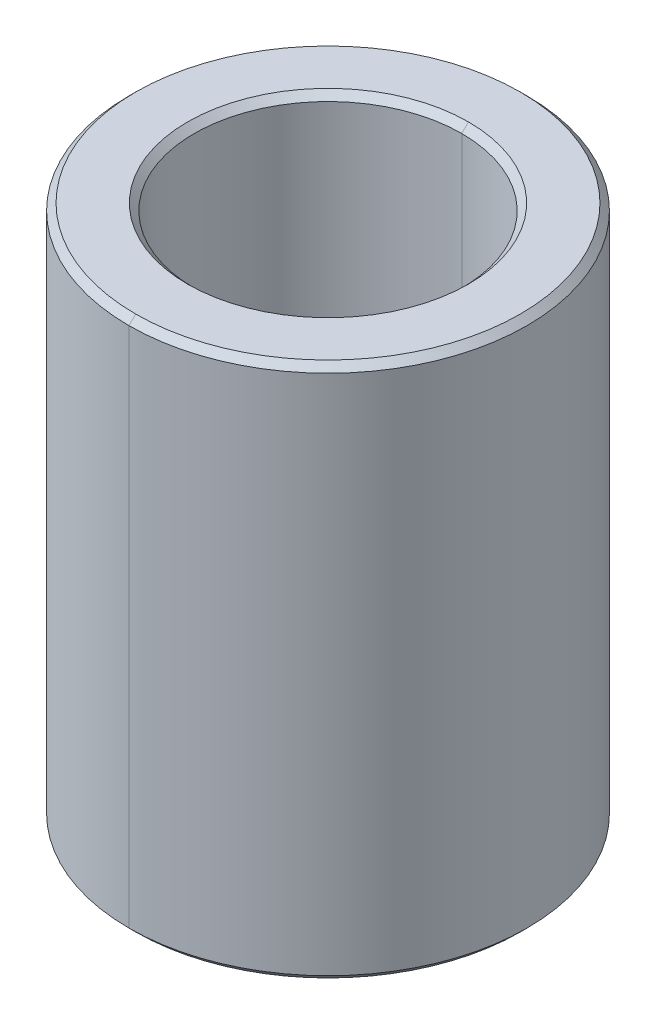
ISO-10303-21;
HEADER;
FILE_DESCRIPTION(('STEP AP214'),'2;1');
FILE_NAME('part.step','',(''),(''),'','','');
FILE_SCHEMA(('AUTOMOTIVE_DESIGN { 1 0 10303 214 1 1 1 1 }'));
ENDSEC;
DATA;
#1=APPLICATION_CONTEXT('core data for automotive mechanical design processes');
#2=APPLICATION_PROTOCOL_DEFINITION('international standard','automotive_design',2000,#1);
#3=PRODUCT_CONTEXT('',#1,'mechanical');
#4=PRODUCT('Part','Part','',(#3));
#5=PRODUCT_RELATED_PRODUCT_CATEGORY('part','',(#4));
#6=PRODUCT_DEFINITION_FORMATION('','',#4);
#7=PRODUCT_DEFINITION_CONTEXT('part definition',#1,'design');
#8=PRODUCT_DEFINITION('design','',#6,#7);
#9=PRODUCT_DEFINITION_SHAPE('','',#8);
#10=(LENGTH_UNIT() NAMED_UNIT(*) SI_UNIT(.MILLI.,.METRE.));
#11=(NAMED_UNIT(*) PLANE_ANGLE_UNIT() SI_UNIT($,.RADIAN.));
#12=(NAMED_UNIT(*) SI_UNIT($,.STERADIAN.) SOLID_ANGLE_UNIT());
#13=UNCERTAINTY_MEASURE_WITH_UNIT(LENGTH_MEASURE(1.E-05),#10,'distance_accuracy_value','');
#14=(GEOMETRIC_REPRESENTATION_CONTEXT(3) GLOBAL_UNCERTAINTY_ASSIGNED_CONTEXT((#13)) GLOBAL_UNIT_ASSIGNED_CONTEXT((#10,
#11,#12)) REPRESENTATION_CONTEXT('',''));
#15=CARTESIAN_POINT('',(0.,0.,0.));
#16=DIRECTION('',(0.,0.,1.));
#17=DIRECTION('',(1.,0.,0.));
#18=AXIS2_PLACEMENT_3D('',#15,#16,#17);
#19=CARTESIAN_POINT('',(0.,3.9,0.));
#20=DIRECTION('',(0.,1.,0.));
#21=DIRECTION('',(0.,0.,1.));
#22=AXIS2_PLACEMENT_3D('',#19,#20,#21);
#23=CONICAL_SURFACE('',#22,2.,0.785398163397448);
#24=DIRECTION('',(0.,0.707106781186548,-0.707106781186548));
#25=VECTOR('',#24,1.);
#26=CARTESIAN_POINT('',(0.,3.9,-2.));
#27=LINE('',#26,#25);
#28=CARTESIAN_POINT('',(0.,3.9,-2.));
#29=VERTEX_POINT('',#28);
#30=CARTESIAN_POINT('',(0.,4.,-2.1));
#31=VERTEX_POINT('',#30);
#32=EDGE_CURVE('E135',#29,#31,#27,.T.);
#33=ORIENTED_EDGE('',*,*,#32,.F.);
#34=CARTESIAN_POINT('',(0.,3.9,0.));
#35=DIRECTION('',(0.,1.,0.));
#36=DIRECTION('',(0.,0.,1.));
#37=AXIS2_PLACEMENT_3D('',#34,#35,#36);
#38=CIRCLE('',#37,2.);
#39=CARTESIAN_POINT('',(0.,3.9,2.));
#40=VERTEX_POINT('',#39);
#41=EDGE_CURVE('E24',#40,#29,#38,.T.);
#42=ORIENTED_EDGE('',*,*,#41,.F.);
#43=DIRECTION('',(0.,0.707106781186548,0.707106781186548));
#44=VECTOR('',#43,1.);
#45=CARTESIAN_POINT('',(0.,3.9,2.));
#46=LINE('',#45,#44);
#47=CARTESIAN_POINT('',(0.,4.,2.1));
#48=VERTEX_POINT('',#47);
#49=EDGE_CURVE('E145',#40,#48,#46,.T.);
#50=ORIENTED_EDGE('',*,*,#49,.T.);
#51=CARTESIAN_POINT('',(0.,4.,0.));
#52=DIRECTION('',(0.,-1.,0.));
#53=DIRECTION('',(0.,0.,1.));
#54=AXIS2_PLACEMENT_3D('',#51,#52,#53);
#55=CIRCLE('',#54,2.1);
#56=EDGE_CURVE('E137',#31,#48,#55,.T.);
#57=ORIENTED_EDGE('',*,*,#56,.F.);
#58=EDGE_LOOP('',(#33,#42,#50,#57));
#59=FACE_BOUND('',#58,.T.);
#60=ADVANCED_FACE('F14',(#59),#23,.F.);
#61=CARTESIAN_POINT('',(0.,-4.,0.));
#62=DIRECTION('',(0.,-1.,0.));
#63=DIRECTION('',(0.,0.,-1.));
#64=AXIS2_PLACEMENT_3D('',#61,#62,#63);
#65=CONICAL_SURFACE('',#64,2.1,0.785398163397443);
#66=DIRECTION('',(0.,-0.707106781186551,0.707106781186545));
#67=VECTOR('',#66,1.);
#68=CARTESIAN_POINT('',(0.,-4.,2.1));
#69=LINE('',#68,#67);
#70=CARTESIAN_POINT('',(0.,-3.9,2.));
#71=VERTEX_POINT('',#70);
#72=CARTESIAN_POINT('',(0.,-4.,2.1));
#73=VERTEX_POINT('',#72);
#74=EDGE_CURVE('E164',#71,#73,#69,.T.);
#75=ORIENTED_EDGE('',*,*,#74,.F.);
#76=CARTESIAN_POINT('',(0.,-3.9,0.));
#77=DIRECTION('',(0.,-1.,0.));
#78=DIRECTION('',(0.,0.,1.));
#79=AXIS2_PLACEMENT_3D('',#76,#77,#78);
#80=CIRCLE('',#79,2.);
#81=CARTESIAN_POINT('',(0.,-3.9,-2.));
#82=VERTEX_POINT('',#81);
#83=EDGE_CURVE('E9',#82,#71,#80,.T.);
#84=ORIENTED_EDGE('',*,*,#83,.F.);
#85=DIRECTION('',(0.,-0.707106781186551,-0.707106781186545));
#86=VECTOR('',#85,1.);
#87=CARTESIAN_POINT('',(0.,-4.,-2.1));
#88=LINE('',#87,#86);
#89=CARTESIAN_POINT('',(0.,-4.,-2.1));
#90=VERTEX_POINT('',#89);
#91=EDGE_CURVE('E173',#82,#90,#88,.T.);
#92=ORIENTED_EDGE('',*,*,#91,.T.);
#93=CARTESIAN_POINT('',(0.,-4.,0.));
#94=DIRECTION('',(0.,1.,0.));
#95=DIRECTION('',(0.,0.,1.));
#96=AXIS2_PLACEMENT_3D('',#93,#94,#95);
#97=CIRCLE('',#96,2.1);
#98=EDGE_CURVE('E18',#73,#90,#97,.T.);
#99=ORIENTED_EDGE('',*,*,#98,.F.);
#100=EDGE_LOOP('',(#75,#84,#92,#99));
#101=FACE_BOUND('',#100,.T.);
#102=ADVANCED_FACE('F266',(#101),#65,.F.);
#103=CARTESIAN_POINT('',(0.,4.,0.));
#104=DIRECTION('',(0.,-1.,0.));
#105=DIRECTION('',(0.,0.,-1.));
#106=AXIS2_PLACEMENT_3D('',#103,#104,#105);
#107=CONICAL_SURFACE('',#106,2.875,0.78539816339744);
#108=DIRECTION('',(0.,-0.707106781186554,0.707106781186542));
#109=VECTOR('',#108,1.);
#110=CARTESIAN_POINT('',(0.,4.,2.875));
#111=LINE('',#110,#109);
#112=CARTESIAN_POINT('',(0.,4.,2.875));
#113=VERTEX_POINT('',#112);
#114=CARTESIAN_POINT('',(0.,3.9,2.975));
#115=VERTEX_POINT('',#114);
#116=EDGE_CURVE('E204',#113,#115,#111,.T.);
#117=ORIENTED_EDGE('',*,*,#116,.F.);
#118=CARTESIAN_POINT('',(0.,4.,0.));
#119=DIRECTION('',(0.,1.,0.));
#120=DIRECTION('',(0.,0.,1.));
#121=AXIS2_PLACEMENT_3D('',#118,#119,#120);
#122=CIRCLE('',#121,2.875);
#123=CARTESIAN_POINT('',(0.,4.,-2.875));
#124=VERTEX_POINT('',#123);
#125=EDGE_CURVE('E157',#124,#113,#122,.T.);
#126=ORIENTED_EDGE('',*,*,#125,.F.);
#127=DIRECTION('',(0.,-0.707106781186554,-0.707106781186542));
#128=VECTOR('',#127,1.);
#129=CARTESIAN_POINT('',(0.,4.,-2.875));
#130=LINE('',#129,#128);
#131=CARTESIAN_POINT('',(0.,3.9,-2.975));
#132=VERTEX_POINT('',#131);
#133=EDGE_CURVE('E199',#124,#132,#130,.T.);
#134=ORIENTED_EDGE('',*,*,#133,.T.);
#135=CARTESIAN_POINT('',(0.,3.9,0.));
#136=DIRECTION('',(0.,-1.,0.));
#137=DIRECTION('',(0.,0.,1.));
#138=AXIS2_PLACEMENT_3D('',#135,#136,#137);
#139=CIRCLE('',#138,2.975);
#140=EDGE_CURVE('E163',#115,#132,#139,.T.);
#141=ORIENTED_EDGE('',*,*,#140,.F.);
#142=EDGE_LOOP('',(#117,#126,#134,#141));
#143=FACE_BOUND('',#142,.T.);
#144=ADVANCED_FACE('F229',(#143),#107,.T.);
#145=CARTESIAN_POINT('',(0.,-3.9,0.));
#146=DIRECTION('',(0.,1.,0.));
#147=DIRECTION('',(0.,0.,1.));
#148=AXIS2_PLACEMENT_3D('',#145,#146,#147);
#149=CONICAL_SURFACE('',#148,2.975,0.78539816339744);
#150=DIRECTION('',(0.,0.707106781186554,-0.707106781186542));
#151=VECTOR('',#150,1.);
#152=CARTESIAN_POINT('',(0.,-3.9,-2.975));
#153=LINE('',#152,#151);
#154=CARTESIAN_POINT('',(0.,-4.,-2.875));
#155=VERTEX_POINT('',#154);
#156=CARTESIAN_POINT('',(0.,-3.9,-2.975));
#157=VERTEX_POINT('',#156);
#158=EDGE_CURVE('E196',#155,#157,#153,.T.);
#159=ORIENTED_EDGE('',*,*,#158,.F.);
#160=CARTESIAN_POINT('',(0.,-4.,0.));
#161=DIRECTION('',(0.,-1.,0.));
#162=DIRECTION('',(0.,0.,1.));
#163=AXIS2_PLACEMENT_3D('',#160,#161,#162);
#164=CIRCLE('',#163,2.875);
#165=CARTESIAN_POINT('',(0.,-4.,2.875));
#166=VERTEX_POINT('',#165);
#167=EDGE_CURVE('E158',#166,#155,#164,.T.);
#168=ORIENTED_EDGE('',*,*,#167,.F.);
#169=DIRECTION('',(0.,0.707106781186554,0.707106781186542));
#170=VECTOR('',#169,1.);
#171=CARTESIAN_POINT('',(0.,-3.9,2.975));
#172=LINE('',#171,#170);
#173=CARTESIAN_POINT('',(0.,-3.9,2.975));
#174=VERTEX_POINT('',#173);
#175=EDGE_CURVE('E184',#166,#174,#172,.T.);
#176=ORIENTED_EDGE('',*,*,#175,.T.);
#177=CARTESIAN_POINT('',(0.,-3.9,0.));
#178=DIRECTION('',(0.,1.,0.));
#179=DIRECTION('',(0.,0.,1.));
#180=AXIS2_PLACEMENT_3D('',#177,#178,#179);
#181=CIRCLE('',#180,2.975);
#182=EDGE_CURVE('E37',#157,#174,#181,.T.);
#183=ORIENTED_EDGE('',*,*,#182,.F.);
#184=EDGE_LOOP('',(#159,#168,#176,#183));
#185=FACE_BOUND('',#184,.T.);
#186=ADVANCED_FACE('F274',(#185),#149,.T.);
#187=CARTESIAN_POINT('',(0.,4.,0.));
#188=DIRECTION('',(0.,-1.,0.));
#189=DIRECTION('',(0.,0.,-1.));
#190=AXIS2_PLACEMENT_3D('',#187,#188,#189);
#191=CYLINDRICAL_SURFACE('',#190,2.);
#192=DIRECTION('',(0.,-1.,0.));
#193=VECTOR('',#192,1.);
#194=CARTESIAN_POINT('',(0.,4.,2.));
#195=LINE('',#194,#193);
#196=EDGE_CURVE('E116',#40,#71,#195,.T.);
#197=ORIENTED_EDGE('',*,*,#196,.F.);
#198=ORIENTED_EDGE('',*,*,#41,.T.);
#199=DIRECTION('',(0.,-1.,0.));
#200=VECTOR('',#199,1.);
#201=CARTESIAN_POINT('',(0.,4.,-2.));
#202=LINE('',#201,#200);
#203=EDGE_CURVE('E113',#29,#82,#202,.T.);
#204=ORIENTED_EDGE('',*,*,#203,.T.);
#205=ORIENTED_EDGE('',*,*,#83,.T.);
#206=EDGE_LOOP('',(#197,#198,#204,#205));
#207=FACE_BOUND('',#206,.T.);
#208=ADVANCED_FACE('F112',(#207),#191,.F.);
#209=CARTESIAN_POINT('',(0.,4.,0.));
#210=DIRECTION('',(0.,-1.,0.));
#211=DIRECTION('',(0.,0.,-1.));
#212=AXIS2_PLACEMENT_3D('',#209,#210,#211);
#213=CYLINDRICAL_SURFACE('',#212,2.975);
#214=DIRECTION('',(0.,-1.,0.));
#215=VECTOR('',#214,1.);
#216=CARTESIAN_POINT('',(0.,4.,2.975));
#217=LINE('',#216,#215);
#218=EDGE_CURVE('E132',#115,#174,#217,.T.);
#219=ORIENTED_EDGE('',*,*,#218,.F.);
#220=ORIENTED_EDGE('',*,*,#140,.T.);
#221=DIRECTION('',(0.,-1.,0.));
#222=VECTOR('',#221,1.);
#223=CARTESIAN_POINT('',(0.,4.,-2.975));
#224=LINE('',#223,#222);
#225=EDGE_CURVE('E155',#132,#157,#224,.T.);
#226=ORIENTED_EDGE('',*,*,#225,.T.);
#227=ORIENTED_EDGE('',*,*,#182,.T.);
#228=EDGE_LOOP('',(#219,#220,#226,#227));
#229=FACE_BOUND('',#228,.T.);
#230=ADVANCED_FACE('F238',(#229),#213,.T.);
#231=CARTESIAN_POINT('',(0.,-4.,0.));
#232=DIRECTION('',(0.,1.,0.));
#233=DIRECTION('',(1.,0.,0.));
#234=AXIS2_PLACEMENT_3D('',#231,#232,#233);
#235=PLANE('',#234);
#236=CARTESIAN_POINT('',(0.,-4.,0.));
#237=DIRECTION('',(0.,1.,0.));
#238=DIRECTION('',(0.,0.,1.));
#239=AXIS2_PLACEMENT_3D('',#236,#237,#238);
#240=CIRCLE('',#239,2.1);
#241=EDGE_CURVE('E167',#90,#73,#240,.T.);
#242=ORIENTED_EDGE('',*,*,#241,.T.);
#243=ORIENTED_EDGE('',*,*,#98,.T.);
#244=EDGE_LOOP('',(#242,#243));
#245=FACE_BOUND('',#244,.T.);
#246=ORIENTED_EDGE('',*,*,#167,.T.);
#247=CARTESIAN_POINT('',(0.,-4.,0.));
#248=DIRECTION('',(0.,-1.,0.));
#249=DIRECTION('',(0.,0.,1.));
#250=AXIS2_PLACEMENT_3D('',#247,#248,#249);
#251=CIRCLE('',#250,2.875);
#252=EDGE_CURVE('E211',#155,#166,#251,.T.);
#253=ORIENTED_EDGE('',*,*,#252,.T.);
#254=EDGE_LOOP('',(#246,#253));
#255=FACE_BOUND('',#254,.T.);
#256=ADVANCED_FACE('F255',(#245,#255),#235,.F.);
#257=CARTESIAN_POINT('',(0.,4.,0.));
#258=DIRECTION('',(0.,1.,0.));
#259=DIRECTION('',(1.,0.,0.));
#260=AXIS2_PLACEMENT_3D('',#257,#258,#259);
#261=PLANE('',#260);
#262=CARTESIAN_POINT('',(0.,4.,0.));
#263=DIRECTION('',(0.,-1.,0.));
#264=DIRECTION('',(0.,0.,1.));
#265=AXIS2_PLACEMENT_3D('',#262,#263,#264);
#266=CIRCLE('',#265,2.1);
#267=EDGE_CURVE('E142',#48,#31,#266,.T.);
#268=ORIENTED_EDGE('',*,*,#267,.T.);
#269=ORIENTED_EDGE('',*,*,#56,.T.);
#270=EDGE_LOOP('',(#268,#269));
#271=FACE_BOUND('',#270,.T.);
#272=ORIENTED_EDGE('',*,*,#125,.T.);
#273=CARTESIAN_POINT('',(0.,4.,0.));
#274=DIRECTION('',(0.,1.,0.));
#275=DIRECTION('',(0.,0.,1.));
#276=AXIS2_PLACEMENT_3D('',#273,#274,#275);
#277=CIRCLE('',#276,2.875);
#278=EDGE_CURVE('E210',#113,#124,#277,.T.);
#279=ORIENTED_EDGE('',*,*,#278,.T.);
#280=EDGE_LOOP('',(#272,#279));
#281=FACE_BOUND('',#280,.T.);
#282=ADVANCED_FACE('F16',(#271,#281),#261,.T.);
#283=CARTESIAN_POINT('',(0.,4.,0.));
#284=DIRECTION('',(0.,-1.,0.));
#285=DIRECTION('',(0.,0.,-1.));
#286=AXIS2_PLACEMENT_3D('',#283,#284,#285);
#287=CYLINDRICAL_SURFACE('',#286,2.975);
#288=CARTESIAN_POINT('',(0.,3.9,0.));
#289=DIRECTION('',(0.,-1.,0.));
#290=DIRECTION('',(0.,0.,1.));
#291=AXIS2_PLACEMENT_3D('',#288,#289,#290);
#292=CIRCLE('',#291,2.975);
#293=EDGE_CURVE('E201',#132,#115,#292,.T.);
#294=ORIENTED_EDGE('',*,*,#293,.T.);
#295=ORIENTED_EDGE('',*,*,#218,.T.);
#296=CARTESIAN_POINT('',(0.,-3.9,0.));
#297=DIRECTION('',(0.,1.,0.));
#298=DIRECTION('',(0.,0.,1.));
#299=AXIS2_PLACEMENT_3D('',#296,#297,#298);
#300=CIRCLE('',#299,2.975);
#301=EDGE_CURVE('E182',#174,#157,#300,.T.);
#302=ORIENTED_EDGE('',*,*,#301,.T.);
#303=ORIENTED_EDGE('',*,*,#225,.F.);
#304=EDGE_LOOP('',(#294,#295,#302,#303));
#305=FACE_BOUND('',#304,.T.);
#306=ADVANCED_FACE('F237',(#305),#287,.T.);
#307=CARTESIAN_POINT('',(0.,4.,0.));
#308=DIRECTION('',(0.,-1.,0.));
#309=DIRECTION('',(0.,0.,-1.));
#310=AXIS2_PLACEMENT_3D('',#307,#308,#309);
#311=CYLINDRICAL_SURFACE('',#310,2.);
#312=CARTESIAN_POINT('',(0.,3.9,0.));
#313=DIRECTION('',(0.,1.,0.));
#314=DIRECTION('',(0.,0.,1.));
#315=AXIS2_PLACEMENT_3D('',#312,#313,#314);
#316=CIRCLE('',#315,2.);
#317=EDGE_CURVE('E128',#29,#40,#316,.T.);
#318=ORIENTED_EDGE('',*,*,#317,.T.);
#319=ORIENTED_EDGE('',*,*,#196,.T.);
#320=CARTESIAN_POINT('',(0.,-3.9,0.));
#321=DIRECTION('',(0.,-1.,0.));
#322=DIRECTION('',(0.,0.,1.));
#323=AXIS2_PLACEMENT_3D('',#320,#321,#322);
#324=CIRCLE('',#323,2.);
#325=EDGE_CURVE('E130',#71,#82,#324,.T.);
#326=ORIENTED_EDGE('',*,*,#325,.T.);
#327=ORIENTED_EDGE('',*,*,#203,.F.);
#328=EDGE_LOOP('',(#318,#319,#326,#327));
#329=FACE_BOUND('',#328,.T.);
#330=ADVANCED_FACE('F126',(#329),#311,.F.);
#331=CARTESIAN_POINT('',(0.,-3.9,0.));
#332=DIRECTION('',(0.,1.,0.));
#333=DIRECTION('',(0.,0.,1.));
#334=AXIS2_PLACEMENT_3D('',#331,#332,#333);
#335=CONICAL_SURFACE('',#334,2.975,0.78539816339744);
#336=ORIENTED_EDGE('',*,*,#252,.F.);
#337=ORIENTED_EDGE('',*,*,#158,.T.);
#338=ORIENTED_EDGE('',*,*,#301,.F.);
#339=ORIENTED_EDGE('',*,*,#175,.F.);
#340=EDGE_LOOP('',(#336,#337,#338,#339));
#341=FACE_BOUND('',#340,.T.);
#342=ADVANCED_FACE('F273',(#341),#335,.T.);
#343=CARTESIAN_POINT('',(0.,4.,0.));
#344=DIRECTION('',(0.,-1.,0.));
#345=DIRECTION('',(0.,0.,-1.));
#346=AXIS2_PLACEMENT_3D('',#343,#344,#345);
#347=CONICAL_SURFACE('',#346,2.875,0.78539816339744);
#348=ORIENTED_EDGE('',*,*,#278,.F.);
#349=ORIENTED_EDGE('',*,*,#116,.T.);
#350=ORIENTED_EDGE('',*,*,#293,.F.);
#351=ORIENTED_EDGE('',*,*,#133,.F.);
#352=EDGE_LOOP('',(#348,#349,#350,#351));
#353=FACE_BOUND('',#352,.T.);
#354=ADVANCED_FACE('F234',(#353),#347,.T.);
#355=CARTESIAN_POINT('',(0.,-4.,0.));
#356=DIRECTION('',(0.,-1.,0.));
#357=DIRECTION('',(0.,0.,-1.));
#358=AXIS2_PLACEMENT_3D('',#355,#356,#357);
#359=CONICAL_SURFACE('',#358,2.1,0.785398163397443);
#360=ORIENTED_EDGE('',*,*,#325,.F.);
#361=ORIENTED_EDGE('',*,*,#74,.T.);
#362=ORIENTED_EDGE('',*,*,#241,.F.);
#363=ORIENTED_EDGE('',*,*,#91,.F.);
#364=EDGE_LOOP('',(#360,#361,#362,#363));
#365=FACE_BOUND('',#364,.T.);
#366=ADVANCED_FACE('F288',(#365),#359,.F.);
#367=CARTESIAN_POINT('',(0.,3.9,0.));
#368=DIRECTION('',(0.,1.,0.));
#369=DIRECTION('',(0.,0.,1.));
#370=AXIS2_PLACEMENT_3D('',#367,#368,#369);
#371=CONICAL_SURFACE('',#370,2.,0.785398163397448);
#372=ORIENTED_EDGE('',*,*,#317,.F.);
#373=ORIENTED_EDGE('',*,*,#32,.T.);
#374=ORIENTED_EDGE('',*,*,#267,.F.);
#375=ORIENTED_EDGE('',*,*,#49,.F.);
#376=EDGE_LOOP('',(#372,#373,#374,#375));
#377=FACE_BOUND('',#376,.T.);
#378=ADVANCED_FACE('F144',(#377),#371,.F.);
#379=CLOSED_SHELL('',(#60,#102,#144,#186,#208,#230,#256,#282,#306,#330,#342,#354,#366,#378));
#380=MANIFOLD_SOLID_BREP('B1',#379);
#381=ADVANCED_BREP_SHAPE_REPRESENTATION('',(#18,#380),#14);
#382=SHAPE_DEFINITION_REPRESENTATION(#9,#381);
ENDSEC;
END-ISO-10303-21;
